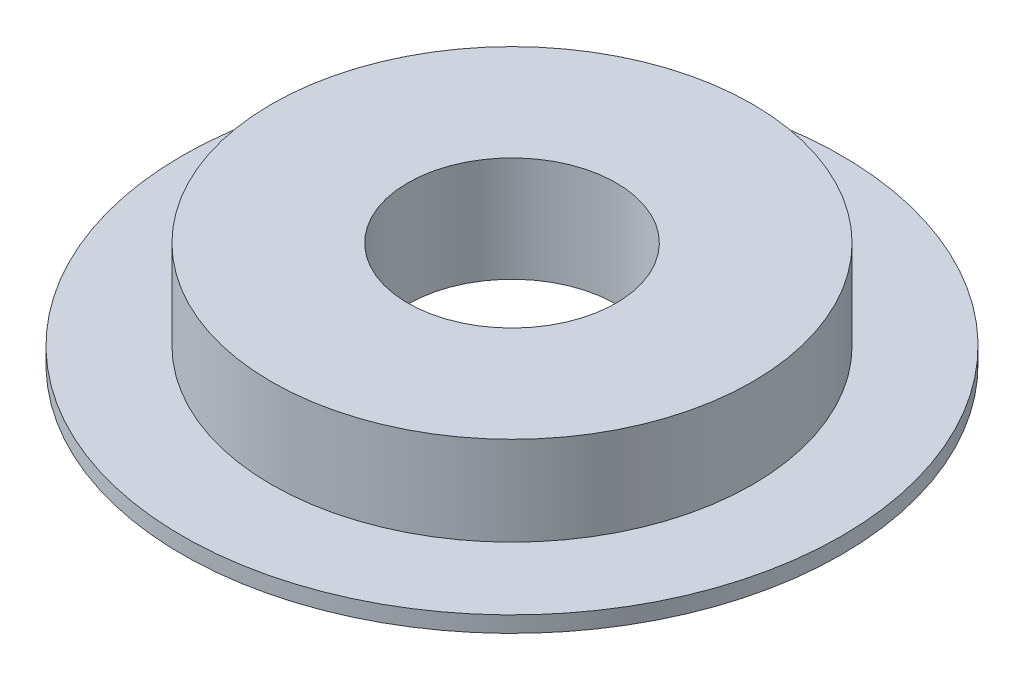
ISO-10303-21;
HEADER;
FILE_DESCRIPTION(('STEP AP214'),'2;1');
FILE_NAME('part.step','',(''),(''),'','','');
FILE_SCHEMA(('AUTOMOTIVE_DESIGN { 1 0 10303 214 1 1 1 1 }'));
ENDSEC;
DATA;
#1=APPLICATION_CONTEXT('core data for automotive mechanical design processes');
#2=APPLICATION_PROTOCOL_DEFINITION('international standard','automotive_design',2000,#1);
#3=PRODUCT_CONTEXT('',#1,'mechanical');
#4=PRODUCT('Part','Part','',(#3));
#5=PRODUCT_RELATED_PRODUCT_CATEGORY('part','',(#4));
#6=PRODUCT_DEFINITION_FORMATION('','',#4);
#7=PRODUCT_DEFINITION_CONTEXT('part definition',#1,'design');
#8=PRODUCT_DEFINITION('design','',#6,#7);
#9=PRODUCT_DEFINITION_SHAPE('','',#8);
#10=(LENGTH_UNIT() NAMED_UNIT(*) SI_UNIT(.MILLI.,.METRE.));
#11=(NAMED_UNIT(*) PLANE_ANGLE_UNIT() SI_UNIT($,.RADIAN.));
#12=(NAMED_UNIT(*) SI_UNIT($,.STERADIAN.) SOLID_ANGLE_UNIT());
#13=UNCERTAINTY_MEASURE_WITH_UNIT(LENGTH_MEASURE(1.E-05),#10,'distance_accuracy_value','');
#14=(GEOMETRIC_REPRESENTATION_CONTEXT(3) GLOBAL_UNCERTAINTY_ASSIGNED_CONTEXT((#13)) GLOBAL_UNIT_ASSIGNED_CONTEXT((#10,
#11,#12)) REPRESENTATION_CONTEXT('',''));
#15=CARTESIAN_POINT('',(0.,0.,0.));
#16=DIRECTION('',(0.,0.,1.));
#17=DIRECTION('',(1.,0.,0.));
#18=AXIS2_PLACEMENT_3D('',#15,#16,#17);
#19=CARTESIAN_POINT('',(-40.7215872800419,8.97288931788123,0.));
#20=DIRECTION('',(0.,1.,0.));
#21=DIRECTION('',(-1.,0.,0.));
#22=AXIS2_PLACEMENT_3D('',#19,#20,#21);
#23=PLANE('',#22);
#24=CARTESIAN_POINT('',(-29.0215872800419,8.97288931788123,0.));
#25=DIRECTION('',(0.,1.,0.));
#26=DIRECTION('',(-1.,0.,0.));
#27=AXIS2_PLACEMENT_3D('',#24,#25,#26);
#28=CIRCLE('',#27,27.);
#29=CARTESIAN_POINT('',(-56.0215872800419,8.97288931788123,0.));
#30=VERTEX_POINT('',#29);
#31=EDGE_CURVE('E10',#30,#30,#28,.T.);
#32=ORIENTED_EDGE('',*,*,#31,.T.);
#33=EDGE_LOOP('',(#32));
#34=FACE_BOUND('',#33,.T.);
#35=CARTESIAN_POINT('',(-29.0215872800419,8.97288931788123,0.));
#36=DIRECTION('',(0.,1.,0.));
#37=DIRECTION('',(-1.,0.,0.));
#38=AXIS2_PLACEMENT_3D('',#35,#36,#37);
#39=CIRCLE('',#38,11.7);
#40=CARTESIAN_POINT('',(-40.7215872800419,8.97288931788123,0.));
#41=VERTEX_POINT('',#40);
#42=EDGE_CURVE('E53',#41,#41,#39,.T.);
#43=ORIENTED_EDGE('',*,*,#42,.F.);
#44=EDGE_LOOP('',(#43));
#45=FACE_BOUND('',#44,.T.);
#46=ADVANCED_FACE('F31',(#34,#45),#23,.T.);
#47=CARTESIAN_POINT('',(-29.0215872800419,13.9728893178812,0.));
#48=DIRECTION('',(0.,1.,0.));
#49=DIRECTION('',(-1.,0.,0.));
#50=AXIS2_PLACEMENT_3D('',#47,#48,#49);
#51=CYLINDRICAL_SURFACE('',#50,27.);
#52=CARTESIAN_POINT('',(-29.0215872800419,-1.02711068211877,0.));
#53=DIRECTION('',(0.,1.,0.));
#54=DIRECTION('',(-1.,0.,0.));
#55=AXIS2_PLACEMENT_3D('',#52,#53,#54);
#56=CIRCLE('',#55,27.);
#57=CARTESIAN_POINT('',(-56.0215872800419,-1.02711068211877,0.));
#58=VERTEX_POINT('',#57);
#59=EDGE_CURVE('E37',#58,#58,#56,.T.);
#60=ORIENTED_EDGE('',*,*,#59,.T.);
#61=EDGE_LOOP('',(#60));
#62=FACE_BOUND('',#61,.T.);
#63=ORIENTED_EDGE('',*,*,#31,.F.);
#64=EDGE_LOOP('',(#63));
#65=FACE_BOUND('',#64,.T.);
#66=ADVANCED_FACE('F61',(#62,#65),#51,.T.);
#67=CARTESIAN_POINT('',(-56.0215872800419,-1.02711068211877,0.));
#68=DIRECTION('',(0.,1.,0.));
#69=DIRECTION('',(-1.,0.,0.));
#70=AXIS2_PLACEMENT_3D('',#67,#68,#69);
#71=PLANE('',#70);
#72=CARTESIAN_POINT('',(-29.0215872800419,-1.02711068211877,0.));
#73=DIRECTION('',(0.,1.,0.));
#74=DIRECTION('',(-1.,0.,0.));
#75=AXIS2_PLACEMENT_3D('',#72,#73,#74);
#76=CIRCLE('',#75,37.);
#77=CARTESIAN_POINT('',(-66.0215872800419,-1.02711068211877,0.));
#78=VERTEX_POINT('',#77);
#79=EDGE_CURVE('E41',#78,#78,#76,.T.);
#80=ORIENTED_EDGE('',*,*,#79,.T.);
#81=EDGE_LOOP('',(#80));
#82=FACE_BOUND('',#81,.T.);
#83=ORIENTED_EDGE('',*,*,#59,.F.);
#84=EDGE_LOOP('',(#83));
#85=FACE_BOUND('',#84,.T.);
#86=ADVANCED_FACE('F65',(#82,#85),#71,.T.);
#87=CARTESIAN_POINT('',(-29.0215872800419,13.9728893178812,0.));
#88=DIRECTION('',(0.,1.,0.));
#89=DIRECTION('',(-1.,0.,0.));
#90=AXIS2_PLACEMENT_3D('',#87,#88,#89);
#91=CYLINDRICAL_SURFACE('',#90,37.);
#92=CARTESIAN_POINT('',(-29.0215872800419,-2.82711068211877,0.));
#93=DIRECTION('',(0.,1.,0.));
#94=DIRECTION('',(-1.,0.,0.));
#95=AXIS2_PLACEMENT_3D('',#92,#93,#94);
#96=CIRCLE('',#95,37.);
#97=CARTESIAN_POINT('',(-66.0215872800419,-2.82711068211877,0.));
#98=VERTEX_POINT('',#97);
#99=EDGE_CURVE('E45',#98,#98,#96,.T.);
#100=ORIENTED_EDGE('',*,*,#99,.T.);
#101=EDGE_LOOP('',(#100));
#102=FACE_BOUND('',#101,.T.);
#103=ORIENTED_EDGE('',*,*,#79,.F.);
#104=EDGE_LOOP('',(#103));
#105=FACE_BOUND('',#104,.T.);
#106=ADVANCED_FACE('F69',(#102,#105),#91,.T.);
#107=CARTESIAN_POINT('',(-66.0215872800419,-2.82711068211877,0.));
#108=DIRECTION('',(0.,-1.,0.));
#109=DIRECTION('',(1.,0.,0.));
#110=AXIS2_PLACEMENT_3D('',#107,#108,#109);
#111=PLANE('',#110);
#112=CARTESIAN_POINT('',(-29.0215872800419,-2.82711068211877,0.));
#113=DIRECTION('',(0.,1.,0.));
#114=DIRECTION('',(-1.,0.,0.));
#115=AXIS2_PLACEMENT_3D('',#112,#113,#114);
#116=CIRCLE('',#115,11.7);
#117=CARTESIAN_POINT('',(-40.7215872800419,-2.82711068211877,0.));
#118=VERTEX_POINT('',#117);
#119=EDGE_CURVE('E50',#118,#118,#116,.T.);
#120=ORIENTED_EDGE('',*,*,#119,.T.);
#121=EDGE_LOOP('',(#120));
#122=FACE_BOUND('',#121,.T.);
#123=ORIENTED_EDGE('',*,*,#99,.F.);
#124=EDGE_LOOP('',(#123));
#125=FACE_BOUND('',#124,.T.);
#126=ADVANCED_FACE('F76',(#122,#125),#111,.T.);
#127=CARTESIAN_POINT('',(-29.0215872800419,13.9728893178812,0.));
#128=DIRECTION('',(0.,1.,0.));
#129=DIRECTION('',(-1.,0.,0.));
#130=AXIS2_PLACEMENT_3D('',#127,#128,#129);
#131=CYLINDRICAL_SURFACE('',#130,11.7);
#132=ORIENTED_EDGE('',*,*,#42,.T.);
#133=EDGE_LOOP('',(#132));
#134=FACE_BOUND('',#133,.T.);
#135=ORIENTED_EDGE('',*,*,#119,.F.);
#136=EDGE_LOOP('',(#135));
#137=FACE_BOUND('',#136,.T.);
#138=ADVANCED_FACE('F57',(#134,#137),#131,.F.);
#139=CLOSED_SHELL('',(#46,#66,#86,#106,#126,#138));
#140=MANIFOLD_SOLID_BREP('B2',#139);
#141=ADVANCED_BREP_SHAPE_REPRESENTATION('',(#18,#140),#14);
#142=SHAPE_DEFINITION_REPRESENTATION(#9,#141);
ENDSEC;
END-ISO-10303-21;
